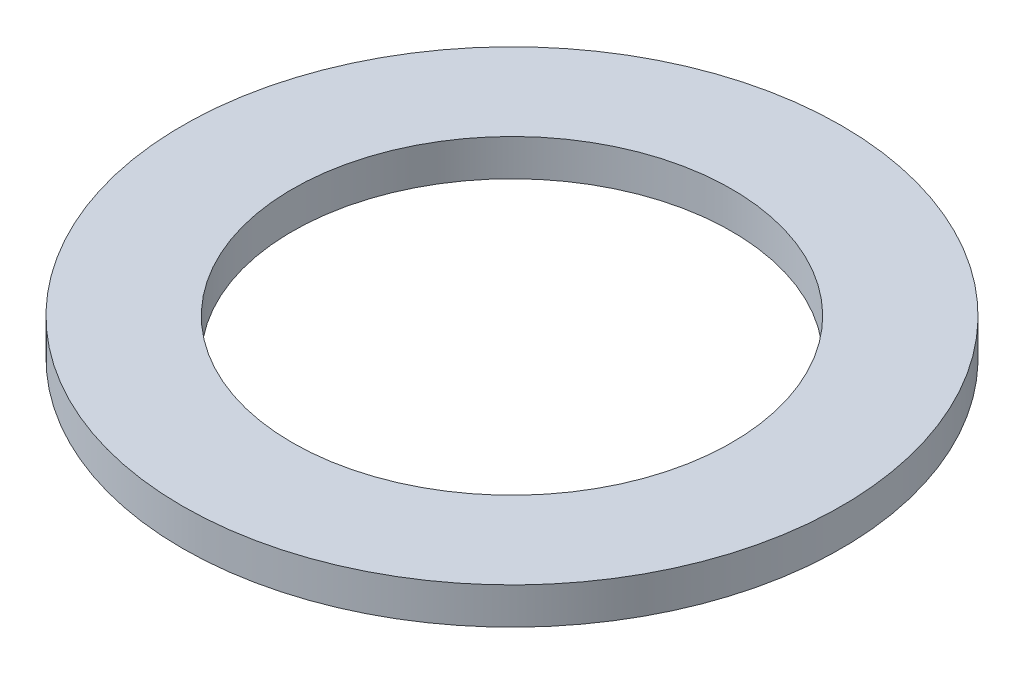
ISO-10303-21;
HEADER;
FILE_DESCRIPTION(('STEP AP214'),'2;1');
FILE_NAME('part.step','',(''),(''),'','','');
FILE_SCHEMA(('AUTOMOTIVE_DESIGN { 1 0 10303 214 1 1 1 1 }'));
ENDSEC;
DATA;
#1=APPLICATION_CONTEXT('core data for automotive mechanical design processes');
#2=APPLICATION_PROTOCOL_DEFINITION('international standard','automotive_design',2000,#1);
#3=PRODUCT_CONTEXT('',#1,'mechanical');
#4=PRODUCT('Part','Part','',(#3));
#5=PRODUCT_RELATED_PRODUCT_CATEGORY('part','',(#4));
#6=PRODUCT_DEFINITION_FORMATION('','',#4);
#7=PRODUCT_DEFINITION_CONTEXT('part definition',#1,'design');
#8=PRODUCT_DEFINITION('design','',#6,#7);
#9=PRODUCT_DEFINITION_SHAPE('','',#8);
#10=(LENGTH_UNIT() NAMED_UNIT(*) SI_UNIT(.MILLI.,.METRE.));
#11=(NAMED_UNIT(*) PLANE_ANGLE_UNIT() SI_UNIT($,.RADIAN.));
#12=(NAMED_UNIT(*) SI_UNIT($,.STERADIAN.) SOLID_ANGLE_UNIT());
#13=UNCERTAINTY_MEASURE_WITH_UNIT(LENGTH_MEASURE(1.E-05),#10,'distance_accuracy_value','');
#14=(GEOMETRIC_REPRESENTATION_CONTEXT(3) GLOBAL_UNCERTAINTY_ASSIGNED_CONTEXT((#13)) GLOBAL_UNIT_ASSIGNED_CONTEXT((#10,
#11,#12)) REPRESENTATION_CONTEXT('',''));
#15=CARTESIAN_POINT('',(0.,0.,0.));
#16=DIRECTION('',(0.,0.,1.));
#17=DIRECTION('',(1.,0.,0.));
#18=AXIS2_PLACEMENT_3D('',#15,#16,#17);
#19=CARTESIAN_POINT('',(0.,5.,0.));
#20=DIRECTION('',(0.,-1.,0.));
#21=DIRECTION('',(0.,0.,-1.));
#22=AXIS2_PLACEMENT_3D('',#19,#20,#21);
#23=CYLINDRICAL_SURFACE('',#22,45.);
#24=CARTESIAN_POINT('',(0.,5.,0.));
#25=DIRECTION('',(0.,1.,0.));
#26=DIRECTION('',(0.,0.,1.));
#27=AXIS2_PLACEMENT_3D('',#24,#25,#26);
#28=CIRCLE('',#27,45.);
#29=CARTESIAN_POINT('',(0.,5.,45.));
#30=VERTEX_POINT('',#29);
#31=EDGE_CURVE('E10',#30,#30,#28,.T.);
#32=ORIENTED_EDGE('',*,*,#31,.F.);
#33=EDGE_LOOP('',(#32));
#34=FACE_BOUND('',#33,.T.);
#35=CARTESIAN_POINT('',(0.,0.,0.));
#36=DIRECTION('',(0.,1.,0.));
#37=DIRECTION('',(0.,0.,1.));
#38=AXIS2_PLACEMENT_3D('',#35,#36,#37);
#39=CIRCLE('',#38,45.);
#40=CARTESIAN_POINT('',(0.,0.,45.));
#41=VERTEX_POINT('',#40);
#42=EDGE_CURVE('E37',#41,#41,#39,.T.);
#43=ORIENTED_EDGE('',*,*,#42,.T.);
#44=EDGE_LOOP('',(#43));
#45=FACE_BOUND('',#44,.T.);
#46=ADVANCED_FACE('F40',(#34,#45),#23,.T.);
#47=CARTESIAN_POINT('',(0.,5.,0.));
#48=DIRECTION('',(0.,1.,0.));
#49=DIRECTION('',(0.,0.,1.));
#50=AXIS2_PLACEMENT_3D('',#47,#48,#49);
#51=PLANE('',#50);
#52=CARTESIAN_POINT('',(0.,5.,0.));
#53=DIRECTION('',(0.,1.,0.));
#54=DIRECTION('',(0.,0.,1.));
#55=AXIS2_PLACEMENT_3D('',#52,#53,#54);
#56=CIRCLE('',#55,30.);
#57=CARTESIAN_POINT('',(0.,5.,30.));
#58=VERTEX_POINT('',#57);
#59=EDGE_CURVE('E50',#58,#58,#56,.T.);
#60=ORIENTED_EDGE('',*,*,#59,.F.);
#61=EDGE_LOOP('',(#60));
#62=FACE_BOUND('',#61,.T.);
#63=ORIENTED_EDGE('',*,*,#31,.T.);
#64=EDGE_LOOP('',(#63));
#65=FACE_BOUND('',#64,.T.);
#66=ADVANCED_FACE('F59',(#62,#65),#51,.T.);
#67=CARTESIAN_POINT('',(0.,0.,0.));
#68=DIRECTION('',(0.,1.,0.));
#69=DIRECTION('',(0.,0.,1.));
#70=AXIS2_PLACEMENT_3D('',#67,#68,#69);
#71=PLANE('',#70);
#72=CARTESIAN_POINT('',(0.,0.,0.));
#73=DIRECTION('',(0.,1.,0.));
#74=DIRECTION('',(0.,0.,1.));
#75=AXIS2_PLACEMENT_3D('',#72,#73,#74);
#76=CIRCLE('',#75,30.);
#77=CARTESIAN_POINT('',(0.,0.,30.));
#78=VERTEX_POINT('',#77);
#79=EDGE_CURVE('E47',#78,#78,#76,.T.);
#80=ORIENTED_EDGE('',*,*,#79,.T.);
#81=EDGE_LOOP('',(#80));
#82=FACE_BOUND('',#81,.T.);
#83=ORIENTED_EDGE('',*,*,#42,.F.);
#84=EDGE_LOOP('',(#83));
#85=FACE_BOUND('',#84,.T.);
#86=ADVANCED_FACE('F58',(#82,#85),#71,.F.);
#87=CARTESIAN_POINT('',(0.,5.,0.));
#88=DIRECTION('',(0.,-1.,0.));
#89=DIRECTION('',(0.,0.,-1.));
#90=AXIS2_PLACEMENT_3D('',#87,#88,#89);
#91=CYLINDRICAL_SURFACE('',#90,30.);
#92=ORIENTED_EDGE('',*,*,#59,.T.);
#93=EDGE_LOOP('',(#92));
#94=FACE_BOUND('',#93,.T.);
#95=ORIENTED_EDGE('',*,*,#79,.F.);
#96=EDGE_LOOP('',(#95));
#97=FACE_BOUND('',#96,.T.);
#98=ADVANCED_FACE('F54',(#94,#97),#91,.F.);
#99=CLOSED_SHELL('',(#46,#66,#86,#98));
#100=MANIFOLD_SOLID_BREP('B2',#99);
#101=ADVANCED_BREP_SHAPE_REPRESENTATION('',(#18,#100),#14);
#102=SHAPE_DEFINITION_REPRESENTATION(#9,#101);
ENDSEC;
END-ISO-10303-21;
